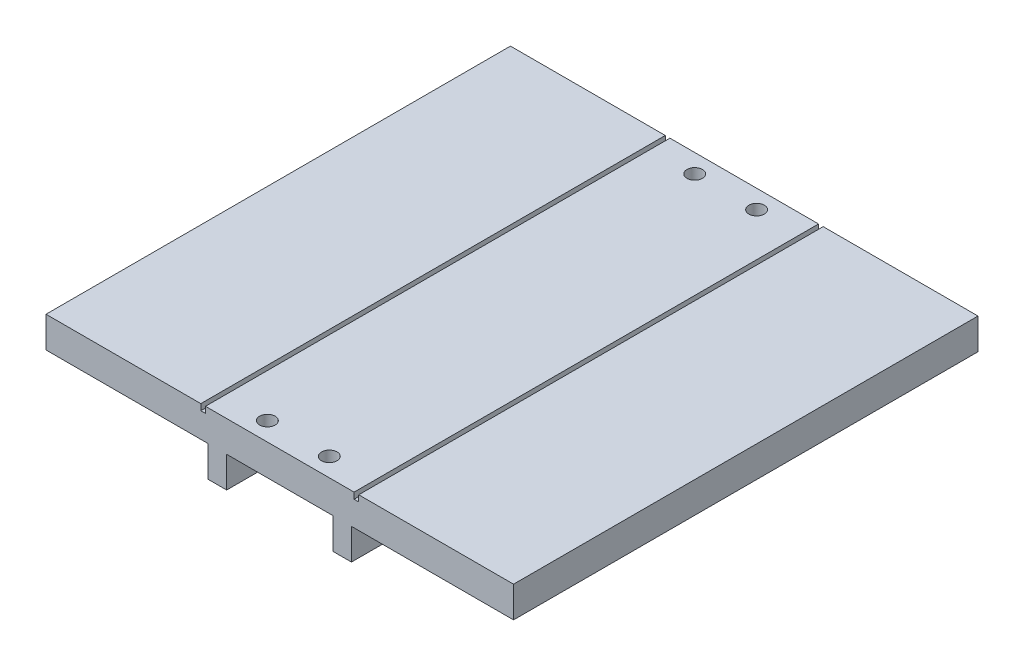
ISO-10303-21;
HEADER;
FILE_DESCRIPTION(('STEP AP214'),'2;1');
FILE_NAME('part.step','',(''),(''),'','','');
FILE_SCHEMA(('AUTOMOTIVE_DESIGN { 1 0 10303 214 1 1 1 1 }'));
ENDSEC;
DATA;
#1=APPLICATION_CONTEXT('core data for automotive mechanical design processes');
#2=APPLICATION_PROTOCOL_DEFINITION('international standard','automotive_design',2000,#1);
#3=PRODUCT_CONTEXT('',#1,'mechanical');
#4=PRODUCT('Part','Part','',(#3));
#5=PRODUCT_RELATED_PRODUCT_CATEGORY('part','',(#4));
#6=PRODUCT_DEFINITION_FORMATION('','',#4);
#7=PRODUCT_DEFINITION_CONTEXT('part definition',#1,'design');
#8=PRODUCT_DEFINITION('design','',#6,#7);
#9=PRODUCT_DEFINITION_SHAPE('','',#8);
#10=(LENGTH_UNIT() NAMED_UNIT(*) SI_UNIT(.MILLI.,.METRE.));
#11=(NAMED_UNIT(*) PLANE_ANGLE_UNIT() SI_UNIT($,.RADIAN.));
#12=(NAMED_UNIT(*) SI_UNIT($,.STERADIAN.) SOLID_ANGLE_UNIT());
#13=UNCERTAINTY_MEASURE_WITH_UNIT(LENGTH_MEASURE(1.E-05),#10,'distance_accuracy_value','');
#14=(GEOMETRIC_REPRESENTATION_CONTEXT(3) GLOBAL_UNCERTAINTY_ASSIGNED_CONTEXT((#13)) GLOBAL_UNIT_ASSIGNED_CONTEXT((#10,
#11,#12)) REPRESENTATION_CONTEXT('',''));
#15=CARTESIAN_POINT('',(0.,0.,0.));
#16=DIRECTION('',(0.,0.,1.));
#17=DIRECTION('',(1.,0.,0.));
#18=AXIS2_PLACEMENT_3D('',#15,#16,#17);
#19=CARTESIAN_POINT('',(-9.99999999999998,9.66690475583124,6.));
#20=DIRECTION('',(0.,-1.,0.));
#21=DIRECTION('',(0.,0.,-1.));
#22=AXIS2_PLACEMENT_3D('',#19,#20,#21);
#23=CYLINDRICAL_SURFACE('',#22,1.65);
#24=CARTESIAN_POINT('',(-9.99999999999998,-4.99999999999998,6.));
#25=DIRECTION('',(0.,-1.,0.));
#26=DIRECTION('',(0.,0.,-1.));
#27=AXIS2_PLACEMENT_3D('',#24,#25,#26);
#28=CIRCLE('',#27,1.65);
#29=CARTESIAN_POINT('',(-9.99999999999998,-4.99999999999998,4.35));
#30=VERTEX_POINT('',#29);
#31=EDGE_CURVE('E240',#30,#30,#28,.T.);
#32=ORIENTED_EDGE('',*,*,#31,.T.);
#33=EDGE_LOOP('',(#32));
#34=FACE_BOUND('',#33,.T.);
#35=CARTESIAN_POINT('',(-9.99999999999998,-2.,6.));
#36=DIRECTION('',(0.,1.,0.));
#37=DIRECTION('',(-1.,0.,0.));
#38=AXIS2_PLACEMENT_3D('',#35,#36,#37);
#39=CIRCLE('',#38,1.65);
#40=CARTESIAN_POINT('',(-11.65,-2.,6.));
#41=VERTEX_POINT('',#40);
#42=EDGE_CURVE('E41',#41,#41,#39,.F.);
#43=ORIENTED_EDGE('',*,*,#42,.F.);
#44=EDGE_LOOP('',(#43));
#45=FACE_BOUND('',#44,.T.);
#46=ADVANCED_FACE('F37',(#34,#45),#23,.F.);
#47=CARTESIAN_POINT('',(10.,9.66690475583124,144.));
#48=DIRECTION('',(0.,-1.,0.));
#49=DIRECTION('',(0.,0.,-1.));
#50=AXIS2_PLACEMENT_3D('',#47,#48,#49);
#51=CYLINDRICAL_SURFACE('',#50,1.65);
#52=CARTESIAN_POINT('',(10.,-4.99999999999998,144.));
#53=DIRECTION('',(0.,-1.,0.));
#54=DIRECTION('',(0.,0.,1.));
#55=AXIS2_PLACEMENT_3D('',#52,#53,#54);
#56=CIRCLE('',#55,1.65);
#57=CARTESIAN_POINT('',(10.,-4.99999999999998,145.65));
#58=VERTEX_POINT('',#57);
#59=EDGE_CURVE('E208',#58,#58,#56,.T.);
#60=ORIENTED_EDGE('',*,*,#59,.T.);
#61=EDGE_LOOP('',(#60));
#62=FACE_BOUND('',#61,.T.);
#63=CARTESIAN_POINT('',(10.,-2.,144.));
#64=DIRECTION('',(0.,1.,0.));
#65=DIRECTION('',(-1.,0.,0.));
#66=AXIS2_PLACEMENT_3D('',#63,#64,#65);
#67=CIRCLE('',#66,1.65);
#68=CARTESIAN_POINT('',(8.35000000000003,-2.,144.));
#69=VERTEX_POINT('',#68);
#70=EDGE_CURVE('E339',#69,#69,#67,.F.);
#71=ORIENTED_EDGE('',*,*,#70,.F.);
#72=EDGE_LOOP('',(#71));
#73=FACE_BOUND('',#72,.T.);
#74=ADVANCED_FACE('F349',(#62,#73),#51,.F.);
#75=CARTESIAN_POINT('',(-10.,9.66690475583124,144.));
#76=DIRECTION('',(0.,-1.,0.));
#77=DIRECTION('',(0.,0.,-1.));
#78=AXIS2_PLACEMENT_3D('',#75,#76,#77);
#79=CYLINDRICAL_SURFACE('',#78,1.65);
#80=CARTESIAN_POINT('',(-10.,-4.99999999999998,144.));
#81=DIRECTION('',(0.,-1.,0.));
#82=DIRECTION('',(0.,0.,-1.));
#83=AXIS2_PLACEMENT_3D('',#80,#81,#82);
#84=CIRCLE('',#83,1.65);
#85=CARTESIAN_POINT('',(-10.,-4.99999999999998,142.35));
#86=VERTEX_POINT('',#85);
#87=EDGE_CURVE('E236',#86,#86,#84,.T.);
#88=ORIENTED_EDGE('',*,*,#87,.T.);
#89=EDGE_LOOP('',(#88));
#90=FACE_BOUND('',#89,.T.);
#91=CARTESIAN_POINT('',(-10.,-2.,144.));
#92=DIRECTION('',(0.,1.,0.));
#93=DIRECTION('',(-1.,0.,0.));
#94=AXIS2_PLACEMENT_3D('',#91,#92,#93);
#95=CIRCLE('',#94,1.65);
#96=CARTESIAN_POINT('',(-11.65,-2.,144.));
#97=VERTEX_POINT('',#96);
#98=EDGE_CURVE('E336',#97,#97,#95,.F.);
#99=ORIENTED_EDGE('',*,*,#98,.F.);
#100=EDGE_LOOP('',(#99));
#101=FACE_BOUND('',#100,.T.);
#102=ADVANCED_FACE('F355',(#90,#101),#79,.F.);
#103=CARTESIAN_POINT('',(9.99999999999998,9.66690475583124,6.));
#104=DIRECTION('',(0.,-1.,0.));
#105=DIRECTION('',(0.,0.,-1.));
#106=AXIS2_PLACEMENT_3D('',#103,#104,#105);
#107=CYLINDRICAL_SURFACE('',#106,1.65);
#108=CARTESIAN_POINT('',(9.99999999999998,-4.99999999999998,6.));
#109=DIRECTION('',(0.,-1.,0.));
#110=DIRECTION('',(0.,0.,1.));
#111=AXIS2_PLACEMENT_3D('',#108,#109,#110);
#112=CIRCLE('',#111,1.65);
#113=CARTESIAN_POINT('',(9.99999999999998,-4.99999999999998,7.65));
#114=VERTEX_POINT('',#113);
#115=EDGE_CURVE('E237',#114,#114,#112,.T.);
#116=ORIENTED_EDGE('',*,*,#115,.T.);
#117=EDGE_LOOP('',(#116));
#118=FACE_BOUND('',#117,.T.);
#119=CARTESIAN_POINT('',(9.99999999999998,-2.,6.));
#120=DIRECTION('',(0.,1.,0.));
#121=DIRECTION('',(-1.,0.,0.));
#122=AXIS2_PLACEMENT_3D('',#119,#120,#121);
#123=CIRCLE('',#122,1.65);
#124=CARTESIAN_POINT('',(8.34999999999998,-2.,6.));
#125=VERTEX_POINT('',#124);
#126=EDGE_CURVE('E333',#125,#125,#123,.F.);
#127=ORIENTED_EDGE('',*,*,#126,.F.);
#128=EDGE_LOOP('',(#127));
#129=FACE_BOUND('',#128,.T.);
#130=ADVANCED_FACE('F487',(#118,#129),#107,.F.);
#131=CARTESIAN_POINT('',(-75.5,4.99999999999999,150.));
#132=DIRECTION('',(0.,-1.,0.));
#133=DIRECTION('',(1.,0.,0.));
#134=AXIS2_PLACEMENT_3D('',#131,#132,#133);
#135=PLANE('',#134);
#136=DIRECTION('',(-1.,0.,0.));
#137=VECTOR('',#136,1.);
#138=CARTESIAN_POINT('',(-75.5,4.99999999999999,150.));
#139=LINE('',#138,#137);
#140=CARTESIAN_POINT('',(-25.5,5.,150.));
#141=VERTEX_POINT('',#140);
#142=CARTESIAN_POINT('',(-75.5,4.99999999999999,150.));
#143=VERTEX_POINT('',#142);
#144=EDGE_CURVE('E252',#141,#143,#139,.T.);
#145=ORIENTED_EDGE('',*,*,#144,.F.);
#146=DIRECTION('',(0.,0.,1.));
#147=VECTOR('',#146,1.);
#148=CARTESIAN_POINT('',(-25.5,5.,0.));
#149=LINE('',#148,#147);
#150=CARTESIAN_POINT('',(-25.5,5.,0.));
#151=VERTEX_POINT('',#150);
#152=EDGE_CURVE('E182',#151,#141,#149,.T.);
#153=ORIENTED_EDGE('',*,*,#152,.F.);
#154=DIRECTION('',(-1.,0.,0.));
#155=VECTOR('',#154,1.);
#156=CARTESIAN_POINT('',(-75.5,4.99999999999999,0.));
#157=LINE('',#156,#155);
#158=CARTESIAN_POINT('',(-75.5,4.99999999999999,0.));
#159=VERTEX_POINT('',#158);
#160=EDGE_CURVE('E280',#151,#159,#157,.T.);
#161=ORIENTED_EDGE('',*,*,#160,.T.);
#162=DIRECTION('',(0.,0.,-1.));
#163=VECTOR('',#162,1.);
#164=CARTESIAN_POINT('',(-75.5,4.99999999999999,150.));
#165=LINE('',#164,#163);
#166=EDGE_CURVE('E328',#143,#159,#165,.T.);
#167=ORIENTED_EDGE('',*,*,#166,.F.);
#168=EDGE_LOOP('',(#145,#153,#161,#167));
#169=FACE_BOUND('',#168,.T.);
#170=ADVANCED_FACE('F408',(#169),#135,.F.);
#171=CARTESIAN_POINT('',(75.5,5.00000000000001,0.));
#172=VERTEX_POINT('',#171);
#173=CARTESIAN_POINT('',(25.5,5.,0.));
#174=VERTEX_POINT('',#173);
#175=EDGE_CURVE('E281',#172,#174,#157,.T.);
#176=ORIENTED_EDGE('',*,*,#175,.T.);
#177=DIRECTION('',(0.,0.,-1.));
#178=VECTOR('',#177,1.);
#179=CARTESIAN_POINT('',(25.5,5.,0.));
#180=LINE('',#179,#178);
#181=CARTESIAN_POINT('',(25.5,5.,150.));
#182=VERTEX_POINT('',#181);
#183=EDGE_CURVE('E223',#182,#174,#180,.T.);
#184=ORIENTED_EDGE('',*,*,#183,.F.);
#185=CARTESIAN_POINT('',(75.5,5.00000000000001,150.));
#186=VERTEX_POINT('',#185);
#187=EDGE_CURVE('E253',#186,#182,#139,.T.);
#188=ORIENTED_EDGE('',*,*,#187,.F.);
#189=DIRECTION('',(0.,0.,-1.));
#190=VECTOR('',#189,1.);
#191=CARTESIAN_POINT('',(75.5,5.00000000000001,150.));
#192=LINE('',#191,#190);
#193=EDGE_CURVE('E46',#186,#172,#192,.T.);
#194=ORIENTED_EDGE('',*,*,#193,.T.);
#195=EDGE_LOOP('',(#176,#184,#188,#194));
#196=FACE_BOUND('',#195,.T.);
#197=ADVANCED_FACE('F409',(#196),#135,.F.);
#198=CARTESIAN_POINT('',(23.1514578374667,-4.99999999999999,150.));
#199=DIRECTION('',(0.,1.,0.));
#200=DIRECTION('',(-1.,0.,0.));
#201=AXIS2_PLACEMENT_3D('',#198,#199,#200);
#202=PLANE('',#201);
#203=DIRECTION('',(1.,0.,0.));
#204=VECTOR('',#203,1.);
#205=CARTESIAN_POINT('',(23.1514578374667,-4.99999999999999,0.));
#206=LINE('',#205,#204);
#207=CARTESIAN_POINT('',(23.1514578374667,-4.99999999999999,0.));
#208=VERTEX_POINT('',#207);
#209=CARTESIAN_POINT('',(75.5,-4.99999999999999,0.));
#210=VERTEX_POINT('',#209);
#211=EDGE_CURVE('E245',#208,#210,#206,.T.);
#212=ORIENTED_EDGE('',*,*,#211,.T.);
#213=DIRECTION('',(0.,0.,-1.));
#214=VECTOR('',#213,1.);
#215=CARTESIAN_POINT('',(75.5,-4.99999999999999,150.));
#216=LINE('',#215,#214);
#217=CARTESIAN_POINT('',(75.5,-4.99999999999999,150.));
#218=VERTEX_POINT('',#217);
#219=EDGE_CURVE('E11',#218,#210,#216,.T.);
#220=ORIENTED_EDGE('',*,*,#219,.F.);
#221=DIRECTION('',(1.,0.,0.));
#222=VECTOR('',#221,1.);
#223=CARTESIAN_POINT('',(23.1514578374667,-4.99999999999999,150.));
#224=LINE('',#223,#222);
#225=CARTESIAN_POINT('',(23.1514578374667,-4.99999999999999,150.));
#226=VERTEX_POINT('',#225);
#227=EDGE_CURVE('E246',#226,#218,#224,.T.);
#228=ORIENTED_EDGE('',*,*,#227,.F.);
#229=DIRECTION('',(0.,0.,-1.));
#230=VECTOR('',#229,1.);
#231=CARTESIAN_POINT('',(23.1514578374667,-4.99999999999999,150.));
#232=LINE('',#231,#230);
#233=EDGE_CURVE('E275',#226,#208,#232,.T.);
#234=ORIENTED_EDGE('',*,*,#233,.T.);
#235=EDGE_LOOP('',(#212,#220,#228,#234));
#236=FACE_BOUND('',#235,.T.);
#237=ADVANCED_FACE('F39',(#236),#202,.F.);
#238=CARTESIAN_POINT('',(75.5,5.00000000000001,150.));
#239=DIRECTION('',(-1.,0.,0.));
#240=DIRECTION('',(0.,0.,1.));
#241=AXIS2_PLACEMENT_3D('',#238,#239,#240);
#242=PLANE('',#241);
#243=DIRECTION('',(0.,1.,0.));
#244=VECTOR('',#243,1.);
#245=CARTESIAN_POINT('',(75.5,5.00000000000001,0.));
#246=LINE('',#245,#244);
#247=EDGE_CURVE('E278',#210,#172,#246,.T.);
#248=ORIENTED_EDGE('',*,*,#247,.T.);
#249=ORIENTED_EDGE('',*,*,#193,.F.);
#250=DIRECTION('',(0.,1.,0.));
#251=VECTOR('',#250,1.);
#252=CARTESIAN_POINT('',(75.5,5.00000000000001,150.));
#253=LINE('',#252,#251);
#254=EDGE_CURVE('E249',#218,#186,#253,.T.);
#255=ORIENTED_EDGE('',*,*,#254,.F.);
#256=ORIENTED_EDGE('',*,*,#219,.T.);
#257=EDGE_LOOP('',(#248,#249,#255,#256));
#258=FACE_BOUND('',#257,.T.);
#259=ADVANCED_FACE('F406',(#258),#242,.F.);
#260=CARTESIAN_POINT('',(-9.99999999999998,5.,6.));
#261=DIRECTION('',(0.,1.,0.));
#262=DIRECTION('',(-1.,0.,0.));
#263=AXIS2_PLACEMENT_3D('',#260,#261,#262);
#264=CIRCLE('',#263,2.5);
#265=CARTESIAN_POINT('',(-12.5,5.,6.));
#266=VERTEX_POINT('',#265);
#267=EDGE_CURVE('E544',#266,#266,#264,.T.);
#268=ORIENTED_EDGE('',*,*,#267,.F.);
#269=EDGE_LOOP('',(#268));
#270=FACE_BOUND('',#269,.T.);
#271=CARTESIAN_POINT('',(10.,5.,6.));
#272=DIRECTION('',(0.,1.,0.));
#273=DIRECTION('',(-1.,0.,0.));
#274=AXIS2_PLACEMENT_3D('',#271,#272,#273);
#275=CIRCLE('',#274,2.5);
#276=CARTESIAN_POINT('',(7.50000000000003,5.,6.));
#277=VERTEX_POINT('',#276);
#278=EDGE_CURVE('E550',#277,#277,#275,.T.);
#279=ORIENTED_EDGE('',*,*,#278,.F.);
#280=EDGE_LOOP('',(#279));
#281=FACE_BOUND('',#280,.T.);
#282=CARTESIAN_POINT('',(10.,5.,144.));
#283=DIRECTION('',(0.,1.,0.));
#284=DIRECTION('',(-1.,0.,0.));
#285=AXIS2_PLACEMENT_3D('',#282,#283,#284);
#286=CIRCLE('',#285,2.5);
#287=CARTESIAN_POINT('',(7.50000000000003,5.,144.));
#288=VERTEX_POINT('',#287);
#289=EDGE_CURVE('E541',#288,#288,#286,.T.);
#290=ORIENTED_EDGE('',*,*,#289,.F.);
#291=EDGE_LOOP('',(#290));
#292=FACE_BOUND('',#291,.T.);
#293=CARTESIAN_POINT('',(-10.,5.,144.));
#294=DIRECTION('',(0.,1.,0.));
#295=DIRECTION('',(-1.,0.,0.));
#296=AXIS2_PLACEMENT_3D('',#293,#294,#295);
#297=CIRCLE('',#296,2.5);
#298=CARTESIAN_POINT('',(-12.5,5.,144.));
#299=VERTEX_POINT('',#298);
#300=EDGE_CURVE('E536',#299,#299,#297,.T.);
#301=ORIENTED_EDGE('',*,*,#300,.F.);
#302=EDGE_LOOP('',(#301));
#303=FACE_BOUND('',#302,.T.);
#304=CARTESIAN_POINT('',(24.,5.,0.));
#305=VERTEX_POINT('',#304);
#306=CARTESIAN_POINT('',(-24.,5.,0.));
#307=VERTEX_POINT('',#306);
#308=EDGE_CURVE('E285',#305,#307,#157,.T.);
#309=ORIENTED_EDGE('',*,*,#308,.T.);
#310=DIRECTION('',(0.,0.,-1.));
#311=VECTOR('',#310,1.);
#312=CARTESIAN_POINT('',(-24.,5.,0.));
#313=LINE('',#312,#311);
#314=CARTESIAN_POINT('',(-24.,5.,150.));
#315=VERTEX_POINT('',#314);
#316=EDGE_CURVE('E194',#315,#307,#313,.T.);
#317=ORIENTED_EDGE('',*,*,#316,.F.);
#318=CARTESIAN_POINT('',(24.,5.,150.));
#319=VERTEX_POINT('',#318);
#320=EDGE_CURVE('E257',#319,#315,#139,.T.);
#321=ORIENTED_EDGE('',*,*,#320,.F.);
#322=DIRECTION('',(0.,0.,1.));
#323=VECTOR('',#322,1.);
#324=CARTESIAN_POINT('',(24.,5.,0.));
#325=LINE('',#324,#323);
#326=EDGE_CURVE('E215',#305,#319,#325,.T.);
#327=ORIENTED_EDGE('',*,*,#326,.F.);
#328=EDGE_LOOP('',(#309,#317,#321,#327));
#329=FACE_BOUND('',#328,.T.);
#330=ADVANCED_FACE('F403',(#270,#281,#292,#303,#329),#135,.F.);
#331=CARTESIAN_POINT('',(-75.5,4.99999999999999,150.));
#332=DIRECTION('',(1.,0.,0.));
#333=DIRECTION('',(0.,0.,-1.));
#334=AXIS2_PLACEMENT_3D('',#331,#332,#333);
#335=PLANE('',#334);
#336=DIRECTION('',(0.,-1.,0.));
#337=VECTOR('',#336,1.);
#338=CARTESIAN_POINT('',(-75.5,4.99999999999999,0.));
#339=LINE('',#338,#337);
#340=CARTESIAN_POINT('',(-75.5,-5.00000000000001,0.));
#341=VERTEX_POINT('',#340);
#342=EDGE_CURVE('E284',#159,#341,#339,.T.);
#343=ORIENTED_EDGE('',*,*,#342,.T.);
#344=DIRECTION('',(0.,0.,-1.));
#345=VECTOR('',#344,1.);
#346=CARTESIAN_POINT('',(-75.5,-5.00000000000001,150.));
#347=LINE('',#346,#345);
#348=CARTESIAN_POINT('',(-75.5,-5.00000000000001,150.));
#349=VERTEX_POINT('',#348);
#350=EDGE_CURVE('E325',#349,#341,#347,.T.);
#351=ORIENTED_EDGE('',*,*,#350,.F.);
#352=DIRECTION('',(0.,-1.,0.));
#353=VECTOR('',#352,1.);
#354=CARTESIAN_POINT('',(-75.5,4.99999999999999,150.));
#355=LINE('',#354,#353);
#356=EDGE_CURVE('E256',#143,#349,#355,.T.);
#357=ORIENTED_EDGE('',*,*,#356,.F.);
#358=ORIENTED_EDGE('',*,*,#166,.T.);
#359=EDGE_LOOP('',(#343,#351,#357,#358));
#360=FACE_BOUND('',#359,.T.);
#361=ADVANCED_FACE('F399',(#360),#335,.F.);
#362=CARTESIAN_POINT('',(-75.5,-5.00000000000001,150.));
#363=DIRECTION('',(0.,1.,0.));
#364=DIRECTION('',(-1.,0.,0.));
#365=AXIS2_PLACEMENT_3D('',#362,#363,#364);
#366=PLANE('',#365);
#367=DIRECTION('',(1.,0.,0.));
#368=VECTOR('',#367,1.);
#369=CARTESIAN_POINT('',(-75.5,-5.00000000000001,0.));
#370=LINE('',#369,#368);
#371=CARTESIAN_POINT('',(-23.1514578374667,-4.99999999999999,0.));
#372=VERTEX_POINT('',#371);
#373=EDGE_CURVE('E287',#341,#372,#370,.T.);
#374=ORIENTED_EDGE('',*,*,#373,.T.);
#375=DIRECTION('',(0.,0.,-1.));
#376=VECTOR('',#375,1.);
#377=CARTESIAN_POINT('',(-23.1514578374667,-4.99999999999999,150.));
#378=LINE('',#377,#376);
#379=CARTESIAN_POINT('',(-23.1514578374667,-4.99999999999999,150.));
#380=VERTEX_POINT('',#379);
#381=EDGE_CURVE('E322',#380,#372,#378,.T.);
#382=ORIENTED_EDGE('',*,*,#381,.F.);
#383=DIRECTION('',(1.,0.,0.));
#384=VECTOR('',#383,1.);
#385=CARTESIAN_POINT('',(-75.5,-5.00000000000001,150.));
#386=LINE('',#385,#384);
#387=EDGE_CURVE('E259',#349,#380,#386,.T.);
#388=ORIENTED_EDGE('',*,*,#387,.F.);
#389=ORIENTED_EDGE('',*,*,#350,.T.);
#390=EDGE_LOOP('',(#374,#382,#388,#389));
#391=FACE_BOUND('',#390,.T.);
#392=ADVANCED_FACE('F395',(#391),#366,.F.);
#393=CARTESIAN_POINT('',(-23.1514578374667,-15.,150.));
#394=DIRECTION('',(1.,0.,0.));
#395=DIRECTION('',(0.,1.,0.));
#396=AXIS2_PLACEMENT_3D('',#393,#394,#395);
#397=PLANE('',#396);
#398=DIRECTION('',(0.,-1.,0.));
#399=VECTOR('',#398,1.);
#400=CARTESIAN_POINT('',(-23.1514578374667,-15.,0.));
#401=LINE('',#400,#399);
#402=CARTESIAN_POINT('',(-23.1514578374667,-15.,0.));
#403=VERTEX_POINT('',#402);
#404=EDGE_CURVE('E289',#372,#403,#401,.T.);
#405=ORIENTED_EDGE('',*,*,#404,.T.);
#406=DIRECTION('',(0.,0.,-1.));
#407=VECTOR('',#406,1.);
#408=CARTESIAN_POINT('',(-23.1514578374667,-15.,150.));
#409=LINE('',#408,#407);
#410=CARTESIAN_POINT('',(-23.1514578374667,-15.,150.));
#411=VERTEX_POINT('',#410);
#412=EDGE_CURVE('E319',#411,#403,#409,.T.);
#413=ORIENTED_EDGE('',*,*,#412,.F.);
#414=DIRECTION('',(0.,-1.,0.));
#415=VECTOR('',#414,1.);
#416=CARTESIAN_POINT('',(-23.1514578374667,-15.,150.));
#417=LINE('',#416,#415);
#418=EDGE_CURVE('E261',#380,#411,#417,.T.);
#419=ORIENTED_EDGE('',*,*,#418,.F.);
#420=ORIENTED_EDGE('',*,*,#381,.T.);
#421=EDGE_LOOP('',(#405,#413,#419,#420));
#422=FACE_BOUND('',#421,.T.);
#423=ADVANCED_FACE('F391',(#422),#397,.F.);
#424=CARTESIAN_POINT('',(-17.1514578374667,-15.,150.));
#425=DIRECTION('',(0.,1.,0.));
#426=DIRECTION('',(-1.,0.,0.));
#427=AXIS2_PLACEMENT_3D('',#424,#425,#426);
#428=PLANE('',#427);
#429=DIRECTION('',(1.,0.,0.));
#430=VECTOR('',#429,1.);
#431=CARTESIAN_POINT('',(-17.1514578374667,-15.,0.));
#432=LINE('',#431,#430);
#433=CARTESIAN_POINT('',(-17.1514578374667,-15.,0.));
#434=VERTEX_POINT('',#433);
#435=EDGE_CURVE('E291',#403,#434,#432,.T.);
#436=ORIENTED_EDGE('',*,*,#435,.T.);
#437=DIRECTION('',(0.,0.,-1.));
#438=VECTOR('',#437,1.);
#439=CARTESIAN_POINT('',(-17.1514578374667,-15.,150.));
#440=LINE('',#439,#438);
#441=CARTESIAN_POINT('',(-17.1514578374667,-15.,150.));
#442=VERTEX_POINT('',#441);
#443=EDGE_CURVE('E316',#442,#434,#440,.T.);
#444=ORIENTED_EDGE('',*,*,#443,.F.);
#445=DIRECTION('',(1.,0.,0.));
#446=VECTOR('',#445,1.);
#447=CARTESIAN_POINT('',(-17.1514578374667,-15.,150.));
#448=LINE('',#447,#446);
#449=EDGE_CURVE('E263',#411,#442,#448,.T.);
#450=ORIENTED_EDGE('',*,*,#449,.F.);
#451=ORIENTED_EDGE('',*,*,#412,.T.);
#452=EDGE_LOOP('',(#436,#444,#450,#451));
#453=FACE_BOUND('',#452,.T.);
#454=ADVANCED_FACE('F387',(#453),#428,.F.);
#455=CARTESIAN_POINT('',(-17.1514578374667,-4.99999999999999,150.));
#456=DIRECTION('',(-1.,0.,0.));
#457=DIRECTION('',(0.,-1.,0.));
#458=AXIS2_PLACEMENT_3D('',#455,#456,#457);
#459=PLANE('',#458);
#460=DIRECTION('',(0.,1.,0.));
#461=VECTOR('',#460,1.);
#462=CARTESIAN_POINT('',(-17.1514578374667,-4.99999999999999,0.));
#463=LINE('',#462,#461);
#464=CARTESIAN_POINT('',(-17.1514578374667,-4.99999999999999,0.));
#465=VERTEX_POINT('',#464);
#466=EDGE_CURVE('E293',#434,#465,#463,.T.);
#467=ORIENTED_EDGE('',*,*,#466,.T.);
#468=DIRECTION('',(0.,0.,-1.));
#469=VECTOR('',#468,1.);
#470=CARTESIAN_POINT('',(-17.1514578374667,-4.99999999999999,150.));
#471=LINE('',#470,#469);
#472=CARTESIAN_POINT('',(-17.1514578374667,-4.99999999999999,150.));
#473=VERTEX_POINT('',#472);
#474=EDGE_CURVE('E313',#473,#465,#471,.T.);
#475=ORIENTED_EDGE('',*,*,#474,.F.);
#476=DIRECTION('',(0.,1.,0.));
#477=VECTOR('',#476,1.);
#478=CARTESIAN_POINT('',(-17.1514578374667,-4.99999999999999,150.));
#479=LINE('',#478,#477);
#480=EDGE_CURVE('E265',#442,#473,#479,.T.);
#481=ORIENTED_EDGE('',*,*,#480,.F.);
#482=ORIENTED_EDGE('',*,*,#443,.T.);
#483=EDGE_LOOP('',(#467,#475,#481,#482));
#484=FACE_BOUND('',#483,.T.);
#485=ADVANCED_FACE('F383',(#484),#459,.F.);
#486=CARTESIAN_POINT('',(-17.1514578374667,-4.99999999999999,150.));
#487=DIRECTION('',(0.,1.,0.));
#488=DIRECTION('',(-1.,0.,0.));
#489=AXIS2_PLACEMENT_3D('',#486,#487,#488);
#490=PLANE('',#489);
#491=ORIENTED_EDGE('',*,*,#115,.F.);
#492=EDGE_LOOP('',(#491));
#493=FACE_BOUND('',#492,.T.);
#494=ORIENTED_EDGE('',*,*,#87,.F.);
#495=EDGE_LOOP('',(#494));
#496=FACE_BOUND('',#495,.T.);
#497=ORIENTED_EDGE('',*,*,#59,.F.);
#498=EDGE_LOOP('',(#497));
#499=FACE_BOUND('',#498,.T.);
#500=ORIENTED_EDGE('',*,*,#31,.F.);
#501=EDGE_LOOP('',(#500));
#502=FACE_BOUND('',#501,.T.);
#503=DIRECTION('',(1.,0.,0.));
#504=VECTOR('',#503,1.);
#505=CARTESIAN_POINT('',(-17.1514578374667,-4.99999999999999,0.));
#506=LINE('',#505,#504);
#507=CARTESIAN_POINT('',(17.1514578374667,-4.99999999999998,0.));
#508=VERTEX_POINT('',#507);
#509=EDGE_CURVE('E295',#465,#508,#506,.T.);
#510=ORIENTED_EDGE('',*,*,#509,.T.);
#511=DIRECTION('',(0.,0.,-1.));
#512=VECTOR('',#511,1.);
#513=CARTESIAN_POINT('',(17.1514578374667,-4.99999999999998,150.));
#514=LINE('',#513,#512);
#515=CARTESIAN_POINT('',(17.1514578374667,-4.99999999999998,150.));
#516=VERTEX_POINT('',#515);
#517=EDGE_CURVE('E310',#516,#508,#514,.T.);
#518=ORIENTED_EDGE('',*,*,#517,.F.);
#519=DIRECTION('',(1.,0.,0.));
#520=VECTOR('',#519,1.);
#521=CARTESIAN_POINT('',(-17.1514578374667,-4.99999999999999,150.));
#522=LINE('',#521,#520);
#523=EDGE_CURVE('E267',#473,#516,#522,.T.);
#524=ORIENTED_EDGE('',*,*,#523,.F.);
#525=ORIENTED_EDGE('',*,*,#474,.T.);
#526=EDGE_LOOP('',(#510,#518,#524,#525));
#527=FACE_BOUND('',#526,.T.);
#528=ADVANCED_FACE('F379',(#493,#496,#499,#502,#527),#490,.F.);
#529=CARTESIAN_POINT('',(17.1514578374667,-4.99999999999998,150.));
#530=DIRECTION('',(1.,0.,0.));
#531=DIRECTION('',(0.,0.,-1.));
#532=AXIS2_PLACEMENT_3D('',#529,#530,#531);
#533=PLANE('',#532);
#534=DIRECTION('',(0.,-1.,0.));
#535=VECTOR('',#534,1.);
#536=CARTESIAN_POINT('',(17.1514578374667,-4.99999999999998,0.));
#537=LINE('',#536,#535);
#538=CARTESIAN_POINT('',(17.1514578374667,-15.,0.));
#539=VERTEX_POINT('',#538);
#540=EDGE_CURVE('E297',#508,#539,#537,.T.);
#541=ORIENTED_EDGE('',*,*,#540,.T.);
#542=DIRECTION('',(0.,0.,-1.));
#543=VECTOR('',#542,1.);
#544=CARTESIAN_POINT('',(17.1514578374667,-15.,150.));
#545=LINE('',#544,#543);
#546=CARTESIAN_POINT('',(17.1514578374667,-15.,150.));
#547=VERTEX_POINT('',#546);
#548=EDGE_CURVE('E307',#547,#539,#545,.T.);
#549=ORIENTED_EDGE('',*,*,#548,.F.);
#550=DIRECTION('',(0.,-1.,0.));
#551=VECTOR('',#550,1.);
#552=CARTESIAN_POINT('',(17.1514578374667,-4.99999999999998,150.));
#553=LINE('',#552,#551);
#554=EDGE_CURVE('E269',#516,#547,#553,.T.);
#555=ORIENTED_EDGE('',*,*,#554,.F.);
#556=ORIENTED_EDGE('',*,*,#517,.T.);
#557=EDGE_LOOP('',(#541,#549,#555,#556));
#558=FACE_BOUND('',#557,.T.);
#559=ADVANCED_FACE('F375',(#558),#533,.F.);
#560=CARTESIAN_POINT('',(17.1514578374667,-15.,150.));
#561=DIRECTION('',(0.,1.,0.));
#562=DIRECTION('',(0.,0.,1.));
#563=AXIS2_PLACEMENT_3D('',#560,#561,#562);
#564=PLANE('',#563);
#565=DIRECTION('',(1.,0.,0.));
#566=VECTOR('',#565,1.);
#567=CARTESIAN_POINT('',(17.1514578374667,-15.,0.));
#568=LINE('',#567,#566);
#569=CARTESIAN_POINT('',(23.1514578374667,-15.,0.));
#570=VERTEX_POINT('',#569);
#571=EDGE_CURVE('E299',#539,#570,#568,.T.);
#572=ORIENTED_EDGE('',*,*,#571,.T.);
#573=DIRECTION('',(0.,0.,-1.));
#574=VECTOR('',#573,1.);
#575=CARTESIAN_POINT('',(23.1514578374667,-15.,150.));
#576=LINE('',#575,#574);
#577=CARTESIAN_POINT('',(23.1514578374667,-15.,150.));
#578=VERTEX_POINT('',#577);
#579=EDGE_CURVE('E304',#578,#570,#576,.T.);
#580=ORIENTED_EDGE('',*,*,#579,.F.);
#581=DIRECTION('',(1.,0.,0.));
#582=VECTOR('',#581,1.);
#583=CARTESIAN_POINT('',(17.1514578374667,-15.,150.));
#584=LINE('',#583,#582);
#585=EDGE_CURVE('E271',#547,#578,#584,.T.);
#586=ORIENTED_EDGE('',*,*,#585,.F.);
#587=ORIENTED_EDGE('',*,*,#548,.T.);
#588=EDGE_LOOP('',(#572,#580,#586,#587));
#589=FACE_BOUND('',#588,.T.);
#590=ADVANCED_FACE('F371',(#589),#564,.F.);
#591=CARTESIAN_POINT('',(23.1514578374667,-15.,150.));
#592=DIRECTION('',(-1.,0.,0.));
#593=DIRECTION('',(0.,0.,1.));
#594=AXIS2_PLACEMENT_3D('',#591,#592,#593);
#595=PLANE('',#594);
#596=DIRECTION('',(0.,1.,0.));
#597=VECTOR('',#596,1.);
#598=CARTESIAN_POINT('',(23.1514578374667,-15.,0.));
#599=LINE('',#598,#597);
#600=EDGE_CURVE('E250',#570,#208,#599,.T.);
#601=ORIENTED_EDGE('',*,*,#600,.T.);
#602=ORIENTED_EDGE('',*,*,#233,.F.);
#603=DIRECTION('',(0.,1.,0.));
#604=VECTOR('',#603,1.);
#605=CARTESIAN_POINT('',(23.1514578374667,-15.,150.));
#606=LINE('',#605,#604);
#607=EDGE_CURVE('E273',#578,#226,#606,.T.);
#608=ORIENTED_EDGE('',*,*,#607,.F.);
#609=ORIENTED_EDGE('',*,*,#579,.T.);
#610=EDGE_LOOP('',(#601,#602,#608,#609));
#611=FACE_BOUND('',#610,.T.);
#612=ADVANCED_FACE('F364',(#611),#595,.F.);
#613=CARTESIAN_POINT('',(0.,0.,150.));
#614=DIRECTION('',(0.,0.,-1.));
#615=DIRECTION('',(-1.,0.,0.));
#616=AXIS2_PLACEMENT_3D('',#613,#614,#615);
#617=PLANE('',#616);
#618=DIRECTION('',(1.,0.,0.));
#619=VECTOR('',#618,1.);
#620=CARTESIAN_POINT('',(-25.5,3.,150.));
#621=LINE('',#620,#619);
#622=CARTESIAN_POINT('',(-25.5,3.,150.));
#623=VERTEX_POINT('',#622);
#624=CARTESIAN_POINT('',(-24.,3.,150.));
#625=VERTEX_POINT('',#624);
#626=EDGE_CURVE('E190',#623,#625,#621,.T.);
#627=ORIENTED_EDGE('',*,*,#626,.F.);
#628=DIRECTION('',(0.,1.,0.));
#629=VECTOR('',#628,1.);
#630=CARTESIAN_POINT('',(-25.5,3.,150.));
#631=LINE('',#630,#629);
#632=EDGE_CURVE('E177',#623,#141,#631,.T.);
#633=ORIENTED_EDGE('',*,*,#632,.T.);
#634=ORIENTED_EDGE('',*,*,#144,.T.);
#635=ORIENTED_EDGE('',*,*,#356,.T.);
#636=ORIENTED_EDGE('',*,*,#387,.T.);
#637=ORIENTED_EDGE('',*,*,#418,.T.);
#638=ORIENTED_EDGE('',*,*,#449,.T.);
#639=ORIENTED_EDGE('',*,*,#480,.T.);
#640=ORIENTED_EDGE('',*,*,#523,.T.);
#641=ORIENTED_EDGE('',*,*,#554,.T.);
#642=ORIENTED_EDGE('',*,*,#585,.T.);
#643=ORIENTED_EDGE('',*,*,#607,.T.);
#644=ORIENTED_EDGE('',*,*,#227,.T.);
#645=ORIENTED_EDGE('',*,*,#254,.T.);
#646=ORIENTED_EDGE('',*,*,#187,.T.);
#647=DIRECTION('',(0.,1.,0.));
#648=VECTOR('',#647,1.);
#649=CARTESIAN_POINT('',(25.5,3.,150.));
#650=LINE('',#649,#648);
#651=CARTESIAN_POINT('',(25.5,3.,150.));
#652=VERTEX_POINT('',#651);
#653=EDGE_CURVE('E204',#652,#182,#650,.T.);
#654=ORIENTED_EDGE('',*,*,#653,.F.);
#655=DIRECTION('',(1.,0.,0.));
#656=VECTOR('',#655,1.);
#657=CARTESIAN_POINT('',(25.5,3.,150.));
#658=LINE('',#657,#656);
#659=CARTESIAN_POINT('',(24.,3.,150.));
#660=VERTEX_POINT('',#659);
#661=EDGE_CURVE('E220',#660,#652,#658,.T.);
#662=ORIENTED_EDGE('',*,*,#661,.F.);
#663=DIRECTION('',(0.,1.,0.));
#664=VECTOR('',#663,1.);
#665=CARTESIAN_POINT('',(24.,3.,150.));
#666=LINE('',#665,#664);
#667=EDGE_CURVE('E227',#660,#319,#666,.T.);
#668=ORIENTED_EDGE('',*,*,#667,.T.);
#669=ORIENTED_EDGE('',*,*,#320,.T.);
#670=DIRECTION('',(0.,1.,0.));
#671=VECTOR('',#670,1.);
#672=CARTESIAN_POINT('',(-24.,3.,150.));
#673=LINE('',#672,#671);
#674=EDGE_CURVE('E186',#625,#315,#673,.T.);
#675=ORIENTED_EDGE('',*,*,#674,.F.);
#676=EDGE_LOOP('',(#627,#633,#634,#635,#636,#637,#638,#639,#640,#641,#642,#643,#644,#645,#646,
#654,#662,#668,#669,#675));
#677=FACE_BOUND('',#676,.T.);
#678=ADVANCED_FACE('F196',(#677),#617,.F.);
#679=CARTESIAN_POINT('',(0.,0.,0.));
#680=DIRECTION('',(0.,0.,-1.));
#681=DIRECTION('',(-1.,0.,0.));
#682=AXIS2_PLACEMENT_3D('',#679,#680,#681);
#683=PLANE('',#682);
#684=DIRECTION('',(0.,1.,0.));
#685=VECTOR('',#684,1.);
#686=CARTESIAN_POINT('',(-25.5,3.,0.));
#687=LINE('',#686,#685);
#688=CARTESIAN_POINT('',(-25.5,3.,0.));
#689=VERTEX_POINT('',#688);
#690=EDGE_CURVE('E206',#689,#151,#687,.T.);
#691=ORIENTED_EDGE('',*,*,#690,.F.);
#692=DIRECTION('',(-1.,0.,0.));
#693=VECTOR('',#692,1.);
#694=CARTESIAN_POINT('',(-25.5,3.,0.));
#695=LINE('',#694,#693);
#696=CARTESIAN_POINT('',(-24.,3.,0.));
#697=VERTEX_POINT('',#696);
#698=EDGE_CURVE('E187',#697,#689,#695,.T.);
#699=ORIENTED_EDGE('',*,*,#698,.F.);
#700=DIRECTION('',(0.,1.,0.));
#701=VECTOR('',#700,1.);
#702=CARTESIAN_POINT('',(-24.,3.,0.));
#703=LINE('',#702,#701);
#704=EDGE_CURVE('E209',#697,#307,#703,.T.);
#705=ORIENTED_EDGE('',*,*,#704,.T.);
#706=ORIENTED_EDGE('',*,*,#308,.F.);
#707=DIRECTION('',(0.,1.,0.));
#708=VECTOR('',#707,1.);
#709=CARTESIAN_POINT('',(24.,3.,0.));
#710=LINE('',#709,#708);
#711=CARTESIAN_POINT('',(24.,3.,0.));
#712=VERTEX_POINT('',#711);
#713=EDGE_CURVE('E230',#712,#305,#710,.T.);
#714=ORIENTED_EDGE('',*,*,#713,.F.);
#715=DIRECTION('',(-1.,0.,0.));
#716=VECTOR('',#715,1.);
#717=CARTESIAN_POINT('',(25.5,3.,0.));
#718=LINE('',#717,#716);
#719=CARTESIAN_POINT('',(25.5,3.,0.));
#720=VERTEX_POINT('',#719);
#721=EDGE_CURVE('E214',#720,#712,#718,.T.);
#722=ORIENTED_EDGE('',*,*,#721,.F.);
#723=DIRECTION('',(0.,1.,0.));
#724=VECTOR('',#723,1.);
#725=CARTESIAN_POINT('',(25.5,3.,0.));
#726=LINE('',#725,#724);
#727=EDGE_CURVE('E222',#720,#174,#726,.T.);
#728=ORIENTED_EDGE('',*,*,#727,.T.);
#729=ORIENTED_EDGE('',*,*,#175,.F.);
#730=ORIENTED_EDGE('',*,*,#247,.F.);
#731=ORIENTED_EDGE('',*,*,#211,.F.);
#732=ORIENTED_EDGE('',*,*,#600,.F.);
#733=ORIENTED_EDGE('',*,*,#571,.F.);
#734=ORIENTED_EDGE('',*,*,#540,.F.);
#735=ORIENTED_EDGE('',*,*,#509,.F.);
#736=ORIENTED_EDGE('',*,*,#466,.F.);
#737=ORIENTED_EDGE('',*,*,#435,.F.);
#738=ORIENTED_EDGE('',*,*,#404,.F.);
#739=ORIENTED_EDGE('',*,*,#373,.F.);
#740=ORIENTED_EDGE('',*,*,#342,.F.);
#741=ORIENTED_EDGE('',*,*,#160,.F.);
#742=EDGE_LOOP('',(#691,#699,#705,#706,#714,#722,#728,#729,#730,#731,#732,#733,#734,#735,#736,
#737,#738,#739,#740,#741));
#743=FACE_BOUND('',#742,.T.);
#744=ADVANCED_FACE('F363',(#743),#683,.T.);
#745=CARTESIAN_POINT('',(25.5,3.,0.));
#746=DIRECTION('',(1.,0.,0.));
#747=DIRECTION('',(0.,0.,-1.));
#748=AXIS2_PLACEMENT_3D('',#745,#746,#747);
#749=PLANE('',#748);
#750=ORIENTED_EDGE('',*,*,#183,.T.);
#751=ORIENTED_EDGE('',*,*,#727,.F.);
#752=DIRECTION('',(0.,0.,-1.));
#753=VECTOR('',#752,1.);
#754=CARTESIAN_POINT('',(25.5,3.,0.));
#755=LINE('',#754,#753);
#756=EDGE_CURVE('E62',#652,#720,#755,.T.);
#757=ORIENTED_EDGE('',*,*,#756,.F.);
#758=ORIENTED_EDGE('',*,*,#653,.T.);
#759=EDGE_LOOP('',(#750,#751,#757,#758));
#760=FACE_BOUND('',#759,.T.);
#761=ADVANCED_FACE('F367',(#760),#749,.F.);
#762=CARTESIAN_POINT('',(24.,3.,0.));
#763=DIRECTION('',(-1.,0.,0.));
#764=DIRECTION('',(0.,0.,1.));
#765=AXIS2_PLACEMENT_3D('',#762,#763,#764);
#766=PLANE('',#765);
#767=ORIENTED_EDGE('',*,*,#326,.T.);
#768=ORIENTED_EDGE('',*,*,#667,.F.);
#769=DIRECTION('',(0.,0.,1.));
#770=VECTOR('',#769,1.);
#771=CARTESIAN_POINT('',(24.,3.,0.));
#772=LINE('',#771,#770);
#773=EDGE_CURVE('E217',#712,#660,#772,.T.);
#774=ORIENTED_EDGE('',*,*,#773,.F.);
#775=ORIENTED_EDGE('',*,*,#713,.T.);
#776=EDGE_LOOP('',(#767,#768,#774,#775));
#777=FACE_BOUND('',#776,.T.);
#778=ADVANCED_FACE('F482',(#777),#766,.F.);
#779=CARTESIAN_POINT('',(0.,3.,0.));
#780=DIRECTION('',(0.,-1.,0.));
#781=DIRECTION('',(0.,0.,-1.));
#782=AXIS2_PLACEMENT_3D('',#779,#780,#781);
#783=PLANE('',#782);
#784=ORIENTED_EDGE('',*,*,#756,.T.);
#785=ORIENTED_EDGE('',*,*,#721,.T.);
#786=ORIENTED_EDGE('',*,*,#773,.T.);
#787=ORIENTED_EDGE('',*,*,#661,.T.);
#788=EDGE_LOOP('',(#784,#785,#786,#787));
#789=FACE_BOUND('',#788,.T.);
#790=ADVANCED_FACE('F476',(#789),#783,.F.);
#791=CARTESIAN_POINT('',(-25.5,3.,0.));
#792=DIRECTION('',(-1.,0.,0.));
#793=DIRECTION('',(0.,0.,1.));
#794=AXIS2_PLACEMENT_3D('',#791,#792,#793);
#795=PLANE('',#794);
#796=ORIENTED_EDGE('',*,*,#152,.T.);
#797=ORIENTED_EDGE('',*,*,#632,.F.);
#798=DIRECTION('',(0.,0.,1.));
#799=VECTOR('',#798,1.);
#800=CARTESIAN_POINT('',(-25.5,3.,0.));
#801=LINE('',#800,#799);
#802=EDGE_CURVE('E180',#689,#623,#801,.T.);
#803=ORIENTED_EDGE('',*,*,#802,.F.);
#804=ORIENTED_EDGE('',*,*,#690,.T.);
#805=EDGE_LOOP('',(#796,#797,#803,#804));
#806=FACE_BOUND('',#805,.T.);
#807=ADVANCED_FACE('F179',(#806),#795,.F.);
#808=CARTESIAN_POINT('',(-24.,3.,0.));
#809=DIRECTION('',(1.,0.,0.));
#810=DIRECTION('',(0.,0.,-1.));
#811=AXIS2_PLACEMENT_3D('',#808,#809,#810);
#812=PLANE('',#811);
#813=ORIENTED_EDGE('',*,*,#316,.T.);
#814=ORIENTED_EDGE('',*,*,#704,.F.);
#815=DIRECTION('',(0.,0.,-1.));
#816=VECTOR('',#815,1.);
#817=CARTESIAN_POINT('',(-24.,3.,0.));
#818=LINE('',#817,#816);
#819=EDGE_CURVE('E54',#625,#697,#818,.T.);
#820=ORIENTED_EDGE('',*,*,#819,.F.);
#821=ORIENTED_EDGE('',*,*,#674,.T.);
#822=EDGE_LOOP('',(#813,#814,#820,#821));
#823=FACE_BOUND('',#822,.T.);
#824=ADVANCED_FACE('F467',(#823),#812,.F.);
#825=CARTESIAN_POINT('',(0.,3.,0.));
#826=DIRECTION('',(0.,1.,0.));
#827=DIRECTION('',(0.,0.,1.));
#828=AXIS2_PLACEMENT_3D('',#825,#826,#827);
#829=PLANE('',#828);
#830=ORIENTED_EDGE('',*,*,#802,.T.);
#831=ORIENTED_EDGE('',*,*,#626,.T.);
#832=ORIENTED_EDGE('',*,*,#819,.T.);
#833=ORIENTED_EDGE('',*,*,#698,.T.);
#834=EDGE_LOOP('',(#830,#831,#832,#833));
#835=FACE_BOUND('',#834,.T.);
#836=ADVANCED_FACE('F189',(#835),#829,.T.);
#837=CARTESIAN_POINT('',(10.,-2.,6.));
#838=DIRECTION('',(0.,1.,0.));
#839=DIRECTION('',(-1.,0.,0.));
#840=AXIS2_PLACEMENT_3D('',#837,#838,#839);
#841=PLANE('',#840);
#842=CARTESIAN_POINT('',(10.,-2.,6.));
#843=DIRECTION('',(0.,1.,0.));
#844=DIRECTION('',(-1.,0.,0.));
#845=AXIS2_PLACEMENT_3D('',#842,#843,#844);
#846=CIRCLE('',#845,2.5);
#847=CARTESIAN_POINT('',(7.50000000000003,-2.,6.));
#848=VERTEX_POINT('',#847);
#849=EDGE_CURVE('E553',#848,#848,#846,.T.);
#850=ORIENTED_EDGE('',*,*,#849,.T.);
#851=EDGE_LOOP('',(#850));
#852=FACE_BOUND('',#851,.T.);
#853=ORIENTED_EDGE('',*,*,#126,.T.);
#854=EDGE_LOOP('',(#853));
#855=FACE_BOUND('',#854,.T.);
#856=ADVANCED_FACE('F474',(#852,#855),#841,.T.);
#857=CARTESIAN_POINT('',(10.,-2.,6.));
#858=DIRECTION('',(0.,1.,0.));
#859=DIRECTION('',(-1.,0.,0.));
#860=AXIS2_PLACEMENT_3D('',#857,#858,#859);
#861=CYLINDRICAL_SURFACE('',#860,2.5);
#862=ORIENTED_EDGE('',*,*,#849,.F.);
#863=EDGE_LOOP('',(#862));
#864=FACE_BOUND('',#863,.T.);
#865=ORIENTED_EDGE('',*,*,#278,.T.);
#866=EDGE_LOOP('',(#865));
#867=FACE_BOUND('',#866,.T.);
#868=ADVANCED_FACE('F500',(#864,#867),#861,.F.);
#869=CARTESIAN_POINT('',(-10.,-2.,144.));
#870=DIRECTION('',(0.,1.,0.));
#871=DIRECTION('',(-1.,0.,0.));
#872=AXIS2_PLACEMENT_3D('',#869,#870,#871);
#873=PLANE('',#872);
#874=CARTESIAN_POINT('',(-10.,-2.,144.));
#875=DIRECTION('',(0.,1.,0.));
#876=DIRECTION('',(-1.,0.,0.));
#877=AXIS2_PLACEMENT_3D('',#874,#875,#876);
#878=CIRCLE('',#877,2.5);
#879=CARTESIAN_POINT('',(-12.5,-2.,144.));
#880=VERTEX_POINT('',#879);
#881=EDGE_CURVE('E337',#880,#880,#878,.T.);
#882=ORIENTED_EDGE('',*,*,#881,.T.);
#883=EDGE_LOOP('',(#882));
#884=FACE_BOUND('',#883,.T.);
#885=ORIENTED_EDGE('',*,*,#98,.T.);
#886=EDGE_LOOP('',(#885));
#887=FACE_BOUND('',#886,.T.);
#888=ADVANCED_FACE('F506',(#884,#887),#873,.T.);
#889=CARTESIAN_POINT('',(-10.,-2.,144.));
#890=DIRECTION('',(0.,1.,0.));
#891=DIRECTION('',(-1.,0.,0.));
#892=AXIS2_PLACEMENT_3D('',#889,#890,#891);
#893=CYLINDRICAL_SURFACE('',#892,2.5);
#894=ORIENTED_EDGE('',*,*,#881,.F.);
#895=EDGE_LOOP('',(#894));
#896=FACE_BOUND('',#895,.T.);
#897=ORIENTED_EDGE('',*,*,#300,.T.);
#898=EDGE_LOOP('',(#897));
#899=FACE_BOUND('',#898,.T.);
#900=ADVANCED_FACE('F522',(#896,#899),#893,.F.);
#901=CARTESIAN_POINT('',(10.,-2.,144.));
#902=DIRECTION('',(0.,1.,0.));
#903=DIRECTION('',(-1.,0.,0.));
#904=AXIS2_PLACEMENT_3D('',#901,#902,#903);
#905=PLANE('',#904);
#906=CARTESIAN_POINT('',(10.,-2.,144.));
#907=DIRECTION('',(0.,1.,0.));
#908=DIRECTION('',(-1.,0.,0.));
#909=AXIS2_PLACEMENT_3D('',#906,#907,#908);
#910=CIRCLE('',#909,2.5);
#911=CARTESIAN_POINT('',(7.50000000000003,-2.,144.));
#912=VERTEX_POINT('',#911);
#913=EDGE_CURVE('E538',#912,#912,#910,.T.);
#914=ORIENTED_EDGE('',*,*,#913,.T.);
#915=EDGE_LOOP('',(#914));
#916=FACE_BOUND('',#915,.T.);
#917=ORIENTED_EDGE('',*,*,#70,.T.);
#918=EDGE_LOOP('',(#917));
#919=FACE_BOUND('',#918,.T.);
#920=ADVANCED_FACE('F525',(#916,#919),#905,.T.);
#921=CARTESIAN_POINT('',(10.,-2.,144.));
#922=DIRECTION('',(0.,1.,0.));
#923=DIRECTION('',(-1.,0.,0.));
#924=AXIS2_PLACEMENT_3D('',#921,#922,#923);
#925=CYLINDRICAL_SURFACE('',#924,2.5);
#926=ORIENTED_EDGE('',*,*,#913,.F.);
#927=EDGE_LOOP('',(#926));
#928=FACE_BOUND('',#927,.T.);
#929=ORIENTED_EDGE('',*,*,#289,.T.);
#930=EDGE_LOOP('',(#929));
#931=FACE_BOUND('',#930,.T.);
#932=ADVANCED_FACE('F511',(#928,#931),#925,.F.);
#933=CARTESIAN_POINT('',(-9.99999999999998,-2.,6.));
#934=DIRECTION('',(0.,1.,0.));
#935=DIRECTION('',(-1.,0.,0.));
#936=AXIS2_PLACEMENT_3D('',#933,#934,#935);
#937=PLANE('',#936);
#938=CARTESIAN_POINT('',(-9.99999999999998,-2.,6.));
#939=DIRECTION('',(0.,1.,0.));
#940=DIRECTION('',(-1.,0.,0.));
#941=AXIS2_PLACEMENT_3D('',#938,#939,#940);
#942=CIRCLE('',#941,2.5);
#943=CARTESIAN_POINT('',(-12.5,-2.,6.));
#944=VERTEX_POINT('',#943);
#945=EDGE_CURVE('E547',#944,#944,#942,.T.);
#946=ORIENTED_EDGE('',*,*,#945,.T.);
#947=EDGE_LOOP('',(#946));
#948=FACE_BOUND('',#947,.T.);
#949=ORIENTED_EDGE('',*,*,#42,.T.);
#950=EDGE_LOOP('',(#949));
#951=FACE_BOUND('',#950,.T.);
#952=ADVANCED_FACE('F346',(#948,#951),#937,.T.);
#953=CARTESIAN_POINT('',(-9.99999999999998,-2.,6.));
#954=DIRECTION('',(0.,1.,0.));
#955=DIRECTION('',(-1.,0.,0.));
#956=AXIS2_PLACEMENT_3D('',#953,#954,#955);
#957=CYLINDRICAL_SURFACE('',#956,2.5);
#958=ORIENTED_EDGE('',*,*,#945,.F.);
#959=EDGE_LOOP('',(#958));
#960=FACE_BOUND('',#959,.T.);
#961=ORIENTED_EDGE('',*,*,#267,.T.);
#962=EDGE_LOOP('',(#961));
#963=FACE_BOUND('',#962,.T.);
#964=ADVANCED_FACE('F516',(#960,#963),#957,.F.);
#965=CLOSED_SHELL('',(#46,#74,#102,#130,#170,#197,#237,#259,#330,#361,#392,#423,#454,#485,#528,
#559,#590,#612,#678,#744,#761,#778,#790,#807,#824,#836,#856,#868,#888,#900,#920,#932,#952,#964));
#966=MANIFOLD_SOLID_BREP('B2',#965);
#967=ADVANCED_BREP_SHAPE_REPRESENTATION('',(#18,#966),#14);
#968=SHAPE_DEFINITION_REPRESENTATION(#9,#967);
ENDSEC;
END-ISO-10303-21;
